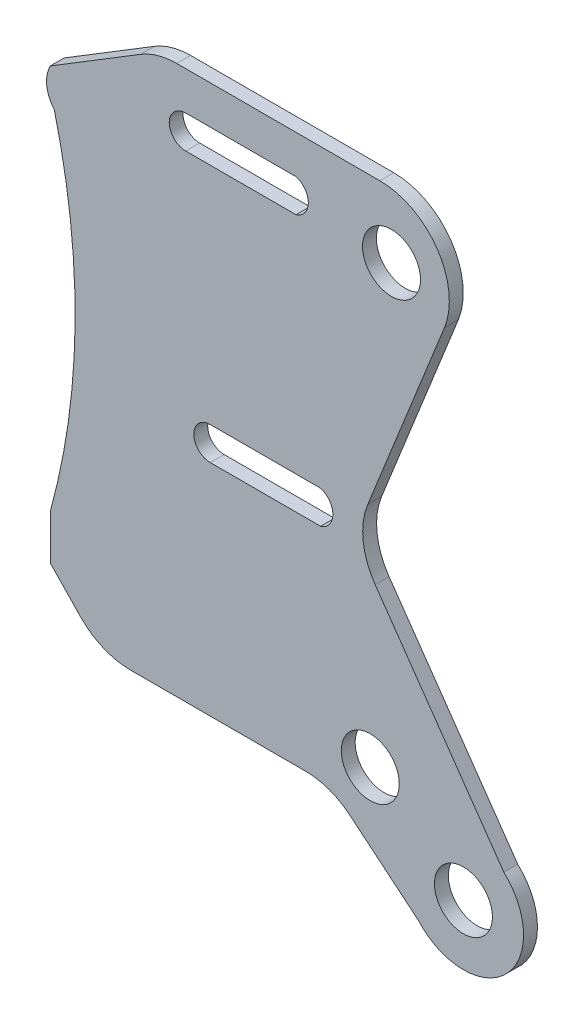
ISO-10303-21;
HEADER;
FILE_DESCRIPTION(('STEP AP214'),'2;1');
FILE_NAME('part.step','',(''),(''),'','','');
FILE_SCHEMA(('AUTOMOTIVE_DESIGN { 1 0 10303 214 1 1 1 1 }'));
ENDSEC;
DATA;
#1=APPLICATION_CONTEXT('core data for automotive mechanical design processes');
#2=APPLICATION_PROTOCOL_DEFINITION('international standard','automotive_design',2000,#1);
#3=PRODUCT_CONTEXT('',#1,'mechanical');
#4=PRODUCT('Part','Part','',(#3));
#5=PRODUCT_RELATED_PRODUCT_CATEGORY('part','',(#4));
#6=PRODUCT_DEFINITION_FORMATION('','',#4);
#7=PRODUCT_DEFINITION_CONTEXT('part definition',#1,'design');
#8=PRODUCT_DEFINITION('design','',#6,#7);
#9=PRODUCT_DEFINITION_SHAPE('','',#8);
#10=(LENGTH_UNIT() NAMED_UNIT(*) SI_UNIT(.MILLI.,.METRE.));
#11=(NAMED_UNIT(*) PLANE_ANGLE_UNIT() SI_UNIT($,.RADIAN.));
#12=(NAMED_UNIT(*) SI_UNIT($,.STERADIAN.) SOLID_ANGLE_UNIT());
#13=UNCERTAINTY_MEASURE_WITH_UNIT(LENGTH_MEASURE(1.E-05),#10,'distance_accuracy_value','');
#14=(GEOMETRIC_REPRESENTATION_CONTEXT(3) GLOBAL_UNCERTAINTY_ASSIGNED_CONTEXT((#13)) GLOBAL_UNIT_ASSIGNED_CONTEXT((#10,
#11,#12)) REPRESENTATION_CONTEXT('',''));
#15=CARTESIAN_POINT('',(0.,0.,0.));
#16=DIRECTION('',(0.,0.,1.));
#17=DIRECTION('',(1.,0.,0.));
#18=AXIS2_PLACEMENT_3D('',#15,#16,#17);
#19=CARTESIAN_POINT('',(7356.27602740988,5480.46152050786,10.));
#20=DIRECTION('',(0.,0.,1.));
#21=DIRECTION('',(1.,0.,0.));
#22=AXIS2_PLACEMENT_3D('',#19,#20,#21);
#23=PLANE('',#22);
#24=CARTESIAN_POINT('',(7633.21644438316,5119.83088755076,10.));
#25=DIRECTION('',(0.,0.,1.));
#26=DIRECTION('',(1.,0.,0.));
#27=AXIS2_PLACEMENT_3D('',#24,#25,#26);
#28=CIRCLE('',#27,20.8632740143078);
#29=CARTESIAN_POINT('',(7654.07971839746,5119.83088755076,10.));
#30=VERTEX_POINT('',#29);
#31=EDGE_CURVE('E267',#30,#30,#28,.T.);
#32=ORIENTED_EDGE('',*,*,#31,.F.);
#33=EDGE_LOOP('',(#32));
#34=FACE_BOUND('',#33,.T.);
#35=CARTESIAN_POINT('',(7356.27602740988,5480.46152050786,10.));
#36=DIRECTION('',(0.,0.,1.));
#37=DIRECTION('',(1.,0.,0.));
#38=AXIS2_PLACEMENT_3D('',#35,#36,#37);
#39=CIRCLE('',#38,23.1074940971523);
#40=CARTESIAN_POINT('',(7335.84521673054,5491.25680922261,10.));
#41=VERTEX_POINT('',#40);
#42=CARTESIAN_POINT('',(7338.75627923221,5465.39451326551,10.));
#43=VERTEX_POINT('',#42);
#44=EDGE_CURVE('E279',#41,#43,#39,.T.);
#45=ORIENTED_EDGE('',*,*,#44,.T.);
#46=CARTESIAN_POINT('',(6862.89927838601,5345.04576288379,10.));
#47=DIRECTION('',(0.,0.,-1.));
#48=DIRECTION('',(-1.,0.,0.));
#49=AXIS2_PLACEMENT_3D('',#46,#47,#48);
#50=CIRCLE('',#49,490.839797665986);
#51=CARTESIAN_POINT('',(7335.84521673054,5213.72232104572,10.));
#52=VERTEX_POINT('',#51);
#53=EDGE_CURVE('E282',#43,#52,#50,.T.);
#54=ORIENTED_EDGE('',*,*,#53,.T.);
#55=DIRECTION('',(0.,-1.,0.));
#56=VECTOR('',#55,1.);
#57=CARTESIAN_POINT('',(7335.84521673054,5213.72232104572,10.));
#58=LINE('',#57,#56);
#59=CARTESIAN_POINT('',(7335.84521673054,5181.42604495919,10.));
#60=VERTEX_POINT('',#59);
#61=EDGE_CURVE('E285',#52,#60,#58,.T.);
#62=ORIENTED_EDGE('',*,*,#61,.T.);
#63=DIRECTION('',(0.69327852464989,-0.720669749094044,0.));
#64=VECTOR('',#63,1.);
#65=CARTESIAN_POINT('',(7335.84521673054,5181.42604495919,10.));
#66=LINE('',#65,#64);
#67=CARTESIAN_POINT('',(7357.51938201795,5158.89553996859,10.));
#68=VERTEX_POINT('',#67);
#69=EDGE_CURVE('E287',#60,#68,#66,.T.);
#70=ORIENTED_EDGE('',*,*,#69,.T.);
#71=CARTESIAN_POINT('',(7393.55286947265,5193.55946620108,10.));
#72=DIRECTION('',(0.,0.,1.));
#73=DIRECTION('',(1.,0.,0.));
#74=AXIS2_PLACEMENT_3D('',#71,#72,#73);
#75=CIRCLE('',#74,49.9999999999999);
#76=CARTESIAN_POINT('',(7393.55286947265,5143.55946620108,10.));
#77=VERTEX_POINT('',#76);
#78=EDGE_CURVE('E289',#68,#77,#75,.T.);
#79=ORIENTED_EDGE('',*,*,#78,.T.);
#80=DIRECTION('',(1.,0.,0.));
#81=VECTOR('',#80,1.);
#82=CARTESIAN_POINT('',(7393.55286947265,5143.55946620108,10.));
#83=LINE('',#82,#81);
#84=CARTESIAN_POINT('',(7519.51954060465,5143.55946620108,10.));
#85=VERTEX_POINT('',#84);
#86=EDGE_CURVE('E291',#77,#85,#83,.T.);
#87=ORIENTED_EDGE('',*,*,#86,.T.);
#88=CARTESIAN_POINT('',(7519.51954060465,5093.55946620108,10.));
#89=DIRECTION('',(0.,0.,-1.));
#90=DIRECTION('',(-1.,0.,0.));
#91=AXIS2_PLACEMENT_3D('',#88,#89,#90);
#92=CIRCLE('',#91,49.9999999999998);
#93=CARTESIAN_POINT('',(7551.41726337819,5132.06317098208,10.));
#94=VERTEX_POINT('',#93);
#95=EDGE_CURVE('E293',#85,#94,#92,.T.);
#96=ORIENTED_EDGE('',*,*,#95,.T.);
#97=DIRECTION('',(0.770074095620001,-0.637954455470794,0.));
#98=VECTOR('',#97,1.);
#99=CARTESIAN_POINT('',(7551.41726337819,5132.06317098208,10.));
#100=LINE('',#99,#98);
#101=CARTESIAN_POINT('',(7600.79956885101,5091.15326117342,10.));
#102=VERTEX_POINT('',#101);
#103=EDGE_CURVE('E295',#94,#102,#100,.T.);
#104=ORIENTED_EDGE('',*,*,#103,.T.);
#105=CARTESIAN_POINT('',(7633.21644438316,5119.83088755076,10.));
#106=DIRECTION('',(0.,0.,1.));
#107=DIRECTION('',(1.,0.,0.));
#108=AXIS2_PLACEMENT_3D('',#105,#106,#107);
#109=CIRCLE('',#108,43.2811745901736);
#110=CARTESIAN_POINT('',(7662.33608576158,5151.85129604124,10.));
#111=VERTEX_POINT('',#110);
#112=EDGE_CURVE('E297',#102,#111,#109,.T.);
#113=ORIENTED_EDGE('',*,*,#112,.T.);
#114=DIRECTION('',(-0.571492903271022,0.820607007958656,0.));
#115=VECTOR('',#114,1.);
#116=CARTESIAN_POINT('',(7569.68086638537,5284.89498198883,10.));
#117=LINE('',#116,#115);
#118=CARTESIAN_POINT('',(7569.68086638537,5284.89498198883,10.));
#119=VERTEX_POINT('',#118);
#120=EDGE_CURVE('E299',#111,#119,#117,.T.);
#121=ORIENTED_EDGE('',*,*,#120,.T.);
#122=CARTESIAN_POINT('',(7610.7112167833,5313.46962715238,10.));
#123=DIRECTION('',(0.,0.,-1.));
#124=DIRECTION('',(1.,0.,0.));
#125=AXIS2_PLACEMENT_3D('',#122,#123,#124);
#126=CIRCLE('',#125,50.0000000000001);
#127=CARTESIAN_POINT('',(7564.30040858429,5332.07169376645,10.));
#128=VERTEX_POINT('',#127);
#129=EDGE_CURVE('E301',#119,#128,#126,.T.);
#130=ORIENTED_EDGE('',*,*,#129,.T.);
#131=DIRECTION('',(0.372041332281536,0.928216163980234,0.));
#132=VECTOR('',#131,1.);
#133=CARTESIAN_POINT('',(7619.47206514531,5469.72097885921,10.));
#134=LINE('',#133,#132);
#135=CARTESIAN_POINT('',(7619.47206514531,5469.72097885921,10.));
#136=VERTEX_POINT('',#135);
#137=EDGE_CURVE('E303',#128,#136,#134,.T.);
#138=ORIENTED_EDGE('',*,*,#137,.T.);
#139=CARTESIAN_POINT('',(7573.0612569463,5488.32304547328,10.));
#140=DIRECTION('',(0.,0.,1.));
#141=DIRECTION('',(-1.,0.,0.));
#142=AXIS2_PLACEMENT_3D('',#139,#140,#141);
#143=CIRCLE('',#142,50.);
#144=CARTESIAN_POINT('',(7573.0612569463,5538.32304547328,10.));
#145=VERTEX_POINT('',#144);
#146=EDGE_CURVE('E305',#136,#145,#143,.T.);
#147=ORIENTED_EDGE('',*,*,#146,.T.);
#148=DIRECTION('',(-1.,0.,0.));
#149=VECTOR('',#148,1.);
#150=CARTESIAN_POINT('',(7426.87365755919,5538.32304547328,10.));
#151=LINE('',#150,#149);
#152=CARTESIAN_POINT('',(7426.87365755919,5538.32304547328,10.));
#153=VERTEX_POINT('',#152);
#154=EDGE_CURVE('E307',#145,#153,#151,.T.);
#155=ORIENTED_EDGE('',*,*,#154,.T.);
#156=CARTESIAN_POINT('',(7426.87365755919,5488.32304547328,10.));
#157=DIRECTION('',(0.,0.,1.));
#158=DIRECTION('',(-1.,0.,0.));
#159=AXIS2_PLACEMENT_3D('',#156,#157,#158);
#160=CIRCLE('',#159,50.);
#161=CARTESIAN_POINT('',(7400.78440837423,5530.97689731535,10.));
#162=VERTEX_POINT('',#161);
#163=EDGE_CURVE('E309',#153,#162,#160,.T.);
#164=ORIENTED_EDGE('',*,*,#163,.T.);
#165=DIRECTION('',(-0.853077036841401,-0.521784983699123,0.));
#166=VECTOR('',#165,1.);
#167=CARTESIAN_POINT('',(7335.84521673054,5491.25680922261,10.));
#168=LINE('',#167,#166);
#169=EDGE_CURVE('E311',#162,#41,#168,.T.);
#170=ORIENTED_EDGE('',*,*,#169,.T.);
#171=EDGE_LOOP('',(#45,#54,#62,#70,#79,#87,#96,#104,#113,#121,#130,#138,#147,#155,#164,#170));
#172=FACE_BOUND('',#171,.T.);
#173=CARTESIAN_POINT('',(7566.17484665191,5169.29533068728,10.));
#174=DIRECTION('',(0.,0.,1.));
#175=DIRECTION('',(1.,0.,0.));
#176=AXIS2_PLACEMENT_3D('',#173,#174,#175);
#177=CIRCLE('',#176,20.8632740143075);
#178=CARTESIAN_POINT('',(7587.03812066622,5169.29533068728,10.));
#179=VERTEX_POINT('',#178);
#180=EDGE_CURVE('E273',#179,#179,#177,.T.);
#181=ORIENTED_EDGE('',*,*,#180,.F.);
#182=EDGE_LOOP('',(#181));
#183=FACE_BOUND('',#182,.T.);
#184=CARTESIAN_POINT('',(7581.43197041039,5491.25680922261,10.));
#185=DIRECTION('',(0.,0.,1.));
#186=DIRECTION('',(1.,0.,0.));
#187=AXIS2_PLACEMENT_3D('',#184,#185,#186);
#188=CIRCLE('',#187,20.8632740143078);
#189=CARTESIAN_POINT('',(7602.2952444247,5491.25680922261,10.));
#190=VERTEX_POINT('',#189);
#191=EDGE_CURVE('E261',#190,#190,#188,.T.);
#192=ORIENTED_EDGE('',*,*,#191,.F.);
#193=EDGE_LOOP('',(#192));
#194=FACE_BOUND('',#193,.T.);
#195=DIRECTION('',(-1.,0.,0.));
#196=VECTOR('',#195,1.);
#197=CARTESIAN_POINT('',(7433.32058826465,5510.67205234695,10.));
#198=LINE('',#197,#196);
#199=CARTESIAN_POINT('',(7512.73477583178,5510.67205234695,10.));
#200=VERTEX_POINT('',#199);
#201=CARTESIAN_POINT('',(7433.32058826465,5510.67205234695,10.));
#202=VERTEX_POINT('',#201);
#203=EDGE_CURVE('E232',#200,#202,#198,.T.);
#204=ORIENTED_EDGE('',*,*,#203,.F.);
#205=CARTESIAN_POINT('',(7509.18663970108,5498.82323077286,10.));
#206=DIRECTION('',(0.,0.,1.));
#207=DIRECTION('',(-1.,0.,0.));
#208=AXIS2_PLACEMENT_3D('',#205,#206,#207);
#209=CIRCLE('',#208,12.3686637393283);
#210=CARTESIAN_POINT('',(7512.73477583178,5486.97440919877,10.));
#211=VERTEX_POINT('',#210);
#212=EDGE_CURVE('E230',#211,#200,#209,.T.);
#213=ORIENTED_EDGE('',*,*,#212,.F.);
#214=DIRECTION('',(1.,0.,0.));
#215=VECTOR('',#214,1.);
#216=CARTESIAN_POINT('',(7512.73477583178,5486.97440919877,10.));
#217=LINE('',#216,#215);
#218=CARTESIAN_POINT('',(7433.32058826465,5486.97440919877,10.));
#219=VERTEX_POINT('',#218);
#220=EDGE_CURVE('E238',#219,#211,#217,.T.);
#221=ORIENTED_EDGE('',*,*,#220,.F.);
#222=CARTESIAN_POINT('',(7433.32058826465,5498.82323077286,10.));
#223=DIRECTION('',(0.,0.,1.));
#224=DIRECTION('',(1.,0.,0.));
#225=AXIS2_PLACEMENT_3D('',#222,#223,#224);
#226=CIRCLE('',#225,11.8488215740884);
#227=EDGE_CURVE('E235',#202,#219,#226,.T.);
#228=ORIENTED_EDGE('',*,*,#227,.F.);
#229=EDGE_LOOP('',(#204,#213,#221,#228));
#230=FACE_BOUND('',#229,.T.);
#231=DIRECTION('',(-1.,0.,0.));
#232=VECTOR('',#231,1.);
#233=CARTESIAN_POINT('',(7451.00945067932,5325.31844872647,10.));
#234=LINE('',#233,#232);
#235=CARTESIAN_POINT('',(7530.42363824645,5325.31844872647,10.));
#236=VERTEX_POINT('',#235);
#237=CARTESIAN_POINT('',(7451.00945067932,5325.31844872647,10.));
#238=VERTEX_POINT('',#237);
#239=EDGE_CURVE('E202',#236,#238,#234,.T.);
#240=ORIENTED_EDGE('',*,*,#239,.F.);
#241=CARTESIAN_POINT('',(7526.87550211575,5313.46962715238,10.));
#242=DIRECTION('',(0.,0.,1.));
#243=DIRECTION('',(-1.,0.,0.));
#244=AXIS2_PLACEMENT_3D('',#241,#242,#243);
#245=CIRCLE('',#244,12.3686637393283);
#246=CARTESIAN_POINT('',(7530.42363824645,5301.62080557829,10.));
#247=VERTEX_POINT('',#246);
#248=EDGE_CURVE('E194',#247,#236,#245,.T.);
#249=ORIENTED_EDGE('',*,*,#248,.F.);
#250=DIRECTION('',(1.,0.,0.));
#251=VECTOR('',#250,1.);
#252=CARTESIAN_POINT('',(7530.42363824645,5301.62080557829,10.));
#253=LINE('',#252,#251);
#254=CARTESIAN_POINT('',(7451.00945067932,5301.62080557829,10.));
#255=VERTEX_POINT('',#254);
#256=EDGE_CURVE('E216',#255,#247,#253,.T.);
#257=ORIENTED_EDGE('',*,*,#256,.F.);
#258=CARTESIAN_POINT('',(7451.00945067932,5313.46962715238,10.));
#259=DIRECTION('',(0.,0.,1.));
#260=DIRECTION('',(1.,0.,0.));
#261=AXIS2_PLACEMENT_3D('',#258,#259,#260);
#262=CIRCLE('',#261,11.8488215740884);
#263=EDGE_CURVE('E214',#238,#255,#262,.T.);
#264=ORIENTED_EDGE('',*,*,#263,.F.);
#265=EDGE_LOOP('',(#240,#249,#257,#264));
#266=FACE_BOUND('',#265,.T.);
#267=ADVANCED_FACE('F33',(#34,#172,#183,#194,#230,#266),#23,.T.);
#268=CARTESIAN_POINT('',(7356.27602740988,5480.46152050786,0.));
#269=DIRECTION('',(0.,0.,1.));
#270=DIRECTION('',(1.,0.,0.));
#271=AXIS2_PLACEMENT_3D('',#268,#269,#270);
#272=PLANE('',#271);
#273=CARTESIAN_POINT('',(7509.18663970108,5498.82323077286,0.));
#274=DIRECTION('',(0.,0.,1.));
#275=DIRECTION('',(-1.,0.,0.));
#276=AXIS2_PLACEMENT_3D('',#273,#274,#275);
#277=CIRCLE('',#276,12.3686637393283);
#278=CARTESIAN_POINT('',(7512.73477583178,5486.97440919877,0.));
#279=VERTEX_POINT('',#278);
#280=CARTESIAN_POINT('',(7512.73477583178,5510.67205234695,0.));
#281=VERTEX_POINT('',#280);
#282=EDGE_CURVE('E210',#279,#281,#277,.T.);
#283=ORIENTED_EDGE('',*,*,#282,.T.);
#284=DIRECTION('',(-1.,0.,0.));
#285=VECTOR('',#284,1.);
#286=CARTESIAN_POINT('',(7433.32058826465,5510.67205234695,0.));
#287=LINE('',#286,#285);
#288=CARTESIAN_POINT('',(7433.32058826465,5510.67205234695,0.));
#289=VERTEX_POINT('',#288);
#290=EDGE_CURVE('E243',#281,#289,#287,.T.);
#291=ORIENTED_EDGE('',*,*,#290,.T.);
#292=CARTESIAN_POINT('',(7433.32058826465,5498.82323077286,0.));
#293=DIRECTION('',(0.,0.,1.));
#294=DIRECTION('',(1.,0.,0.));
#295=AXIS2_PLACEMENT_3D('',#292,#293,#294);
#296=CIRCLE('',#295,11.8488215740884);
#297=CARTESIAN_POINT('',(7433.32058826465,5486.97440919877,0.));
#298=VERTEX_POINT('',#297);
#299=EDGE_CURVE('E246',#289,#298,#296,.T.);
#300=ORIENTED_EDGE('',*,*,#299,.T.);
#301=DIRECTION('',(1.,0.,0.));
#302=VECTOR('',#301,1.);
#303=CARTESIAN_POINT('',(7512.73477583178,5486.97440919877,0.));
#304=LINE('',#303,#302);
#305=EDGE_CURVE('E233',#298,#279,#304,.T.);
#306=ORIENTED_EDGE('',*,*,#305,.T.);
#307=EDGE_LOOP('',(#283,#291,#300,#306));
#308=FACE_BOUND('',#307,.T.);
#309=CARTESIAN_POINT('',(7356.27602740988,5480.46152050786,0.));
#310=DIRECTION('',(0.,0.,1.));
#311=DIRECTION('',(1.,0.,0.));
#312=AXIS2_PLACEMENT_3D('',#309,#310,#311);
#313=CIRCLE('',#312,23.1074940971523);
#314=CARTESIAN_POINT('',(7335.84521673054,5491.25680922261,0.));
#315=VERTEX_POINT('',#314);
#316=CARTESIAN_POINT('',(7338.75627923221,5465.39451326551,0.));
#317=VERTEX_POINT('',#316);
#318=EDGE_CURVE('E276',#315,#317,#313,.T.);
#319=ORIENTED_EDGE('',*,*,#318,.F.);
#320=DIRECTION('',(-0.853077036841401,-0.521784983699123,0.));
#321=VECTOR('',#320,1.);
#322=CARTESIAN_POINT('',(7335.84521673054,5491.25680922261,0.));
#323=LINE('',#322,#321);
#324=CARTESIAN_POINT('',(7400.78440837423,5530.97689731535,0.));
#325=VERTEX_POINT('',#324);
#326=EDGE_CURVE('E283',#325,#315,#323,.T.);
#327=ORIENTED_EDGE('',*,*,#326,.F.);
#328=CARTESIAN_POINT('',(7426.87365755919,5488.32304547328,0.));
#329=DIRECTION('',(0.,0.,1.));
#330=DIRECTION('',(-1.,0.,0.));
#331=AXIS2_PLACEMENT_3D('',#328,#329,#330);
#332=CIRCLE('',#331,50.);
#333=CARTESIAN_POINT('',(7426.87365755919,5538.32304547328,0.));
#334=VERTEX_POINT('',#333);
#335=EDGE_CURVE('E342',#334,#325,#332,.T.);
#336=ORIENTED_EDGE('',*,*,#335,.F.);
#337=DIRECTION('',(-1.,0.,0.));
#338=VECTOR('',#337,1.);
#339=CARTESIAN_POINT('',(7426.87365755919,5538.32304547328,0.));
#340=LINE('',#339,#338);
#341=CARTESIAN_POINT('',(7573.0612569463,5538.32304547328,0.));
#342=VERTEX_POINT('',#341);
#343=EDGE_CURVE('E340',#342,#334,#340,.T.);
#344=ORIENTED_EDGE('',*,*,#343,.F.);
#345=CARTESIAN_POINT('',(7573.0612569463,5488.32304547328,0.));
#346=DIRECTION('',(0.,0.,1.));
#347=DIRECTION('',(-1.,0.,0.));
#348=AXIS2_PLACEMENT_3D('',#345,#346,#347);
#349=CIRCLE('',#348,50.);
#350=CARTESIAN_POINT('',(7619.47206514531,5469.72097885921,0.));
#351=VERTEX_POINT('',#350);
#352=EDGE_CURVE('E338',#351,#342,#349,.T.);
#353=ORIENTED_EDGE('',*,*,#352,.F.);
#354=DIRECTION('',(0.372041332281536,0.928216163980234,0.));
#355=VECTOR('',#354,1.);
#356=CARTESIAN_POINT('',(7619.47206514531,5469.72097885921,0.));
#357=LINE('',#356,#355);
#358=CARTESIAN_POINT('',(7564.30040858429,5332.07169376645,0.));
#359=VERTEX_POINT('',#358);
#360=EDGE_CURVE('E336',#359,#351,#357,.T.);
#361=ORIENTED_EDGE('',*,*,#360,.F.);
#362=CARTESIAN_POINT('',(7610.7112167833,5313.46962715238,0.));
#363=DIRECTION('',(0.,0.,-1.));
#364=DIRECTION('',(1.,0.,0.));
#365=AXIS2_PLACEMENT_3D('',#362,#363,#364);
#366=CIRCLE('',#365,50.0000000000001);
#367=CARTESIAN_POINT('',(7569.68086638537,5284.89498198883,0.));
#368=VERTEX_POINT('',#367);
#369=EDGE_CURVE('E334',#368,#359,#366,.T.);
#370=ORIENTED_EDGE('',*,*,#369,.F.);
#371=DIRECTION('',(-0.571492903271022,0.820607007958656,0.));
#372=VECTOR('',#371,1.);
#373=CARTESIAN_POINT('',(7569.68086638537,5284.89498198883,0.));
#374=LINE('',#373,#372);
#375=CARTESIAN_POINT('',(7662.33608576158,5151.85129604124,0.));
#376=VERTEX_POINT('',#375);
#377=EDGE_CURVE('E332',#376,#368,#374,.T.);
#378=ORIENTED_EDGE('',*,*,#377,.F.);
#379=CARTESIAN_POINT('',(7633.21644438316,5119.83088755076,0.));
#380=DIRECTION('',(0.,0.,1.));
#381=DIRECTION('',(1.,0.,0.));
#382=AXIS2_PLACEMENT_3D('',#379,#380,#381);
#383=CIRCLE('',#382,43.2811745901736);
#384=CARTESIAN_POINT('',(7600.79956885101,5091.15326117342,0.));
#385=VERTEX_POINT('',#384);
#386=EDGE_CURVE('E330',#385,#376,#383,.T.);
#387=ORIENTED_EDGE('',*,*,#386,.F.);
#388=DIRECTION('',(0.770074095620001,-0.637954455470794,0.));
#389=VECTOR('',#388,1.);
#390=CARTESIAN_POINT('',(7551.41726337819,5132.06317098208,0.));
#391=LINE('',#390,#389);
#392=CARTESIAN_POINT('',(7551.41726337819,5132.06317098208,0.));
#393=VERTEX_POINT('',#392);
#394=EDGE_CURVE('E328',#393,#385,#391,.T.);
#395=ORIENTED_EDGE('',*,*,#394,.F.);
#396=CARTESIAN_POINT('',(7519.51954060465,5093.55946620108,0.));
#397=DIRECTION('',(0.,0.,-1.));
#398=DIRECTION('',(-1.,0.,0.));
#399=AXIS2_PLACEMENT_3D('',#396,#397,#398);
#400=CIRCLE('',#399,49.9999999999998);
#401=CARTESIAN_POINT('',(7519.51954060465,5143.55946620108,0.));
#402=VERTEX_POINT('',#401);
#403=EDGE_CURVE('E326',#402,#393,#400,.T.);
#404=ORIENTED_EDGE('',*,*,#403,.F.);
#405=DIRECTION('',(1.,0.,0.));
#406=VECTOR('',#405,1.);
#407=CARTESIAN_POINT('',(7393.55286947265,5143.55946620108,0.));
#408=LINE('',#407,#406);
#409=CARTESIAN_POINT('',(7393.55286947265,5143.55946620108,0.));
#410=VERTEX_POINT('',#409);
#411=EDGE_CURVE('E324',#410,#402,#408,.T.);
#412=ORIENTED_EDGE('',*,*,#411,.F.);
#413=CARTESIAN_POINT('',(7393.55286947265,5193.55946620108,0.));
#414=DIRECTION('',(0.,0.,1.));
#415=DIRECTION('',(1.,0.,0.));
#416=AXIS2_PLACEMENT_3D('',#413,#414,#415);
#417=CIRCLE('',#416,49.9999999999999);
#418=CARTESIAN_POINT('',(7357.51938201795,5158.89553996859,0.));
#419=VERTEX_POINT('',#418);
#420=EDGE_CURVE('E322',#419,#410,#417,.T.);
#421=ORIENTED_EDGE('',*,*,#420,.F.);
#422=DIRECTION('',(0.69327852464989,-0.720669749094044,0.));
#423=VECTOR('',#422,1.);
#424=CARTESIAN_POINT('',(7335.84521673054,5181.42604495919,0.));
#425=LINE('',#424,#423);
#426=CARTESIAN_POINT('',(7335.84521673054,5181.42604495919,0.));
#427=VERTEX_POINT('',#426);
#428=EDGE_CURVE('E320',#427,#419,#425,.T.);
#429=ORIENTED_EDGE('',*,*,#428,.F.);
#430=DIRECTION('',(0.,-1.,0.));
#431=VECTOR('',#430,1.);
#432=CARTESIAN_POINT('',(7335.84521673054,5213.72232104572,0.));
#433=LINE('',#432,#431);
#434=CARTESIAN_POINT('',(7335.84521673054,5213.72232104572,0.));
#435=VERTEX_POINT('',#434);
#436=EDGE_CURVE('E318',#435,#427,#433,.T.);
#437=ORIENTED_EDGE('',*,*,#436,.F.);
#438=CARTESIAN_POINT('',(6862.89927838601,5345.04576288379,0.));
#439=DIRECTION('',(0.,0.,-1.));
#440=DIRECTION('',(-1.,0.,0.));
#441=AXIS2_PLACEMENT_3D('',#438,#439,#440);
#442=CIRCLE('',#441,490.839797665986);
#443=EDGE_CURVE('E316',#317,#435,#442,.T.);
#444=ORIENTED_EDGE('',*,*,#443,.F.);
#445=EDGE_LOOP('',(#319,#327,#336,#344,#353,#361,#370,#378,#387,#395,#404,#412,#421,#429,#437,#444));
#446=FACE_BOUND('',#445,.T.);
#447=CARTESIAN_POINT('',(7566.17484665191,5169.29533068728,0.));
#448=DIRECTION('',(0.,0.,1.));
#449=DIRECTION('',(1.,0.,0.));
#450=AXIS2_PLACEMENT_3D('',#447,#448,#449);
#451=CIRCLE('',#450,20.8632740143075);
#452=CARTESIAN_POINT('',(7587.03812066622,5169.29533068728,0.));
#453=VERTEX_POINT('',#452);
#454=EDGE_CURVE('E270',#453,#453,#451,.T.);
#455=ORIENTED_EDGE('',*,*,#454,.T.);
#456=EDGE_LOOP('',(#455));
#457=FACE_BOUND('',#456,.T.);
#458=CARTESIAN_POINT('',(7633.21644438316,5119.83088755076,0.));
#459=DIRECTION('',(0.,0.,1.));
#460=DIRECTION('',(1.,0.,0.));
#461=AXIS2_PLACEMENT_3D('',#458,#459,#460);
#462=CIRCLE('',#461,20.8632740143078);
#463=CARTESIAN_POINT('',(7654.07971839746,5119.83088755076,0.));
#464=VERTEX_POINT('',#463);
#465=EDGE_CURVE('E264',#464,#464,#462,.T.);
#466=ORIENTED_EDGE('',*,*,#465,.T.);
#467=EDGE_LOOP('',(#466));
#468=FACE_BOUND('',#467,.T.);
#469=CARTESIAN_POINT('',(7581.43197041039,5491.25680922261,0.));
#470=DIRECTION('',(0.,0.,1.));
#471=DIRECTION('',(1.,0.,0.));
#472=AXIS2_PLACEMENT_3D('',#469,#470,#471);
#473=CIRCLE('',#472,20.8632740143078);
#474=CARTESIAN_POINT('',(7602.2952444247,5491.25680922261,0.));
#475=VERTEX_POINT('',#474);
#476=EDGE_CURVE('E260',#475,#475,#473,.T.);
#477=ORIENTED_EDGE('',*,*,#476,.T.);
#478=EDGE_LOOP('',(#477));
#479=FACE_BOUND('',#478,.T.);
#480=CARTESIAN_POINT('',(7526.87550211575,5313.46962715238,0.));
#481=DIRECTION('',(0.,0.,1.));
#482=DIRECTION('',(-1.,0.,0.));
#483=AXIS2_PLACEMENT_3D('',#480,#481,#482);
#484=CIRCLE('',#483,12.3686637393283);
#485=CARTESIAN_POINT('',(7530.42363824645,5301.62080557829,0.));
#486=VERTEX_POINT('',#485);
#487=CARTESIAN_POINT('',(7530.42363824645,5325.31844872647,0.));
#488=VERTEX_POINT('',#487);
#489=EDGE_CURVE('E56',#486,#488,#484,.T.);
#490=ORIENTED_EDGE('',*,*,#489,.T.);
#491=DIRECTION('',(-1.,0.,0.));
#492=VECTOR('',#491,1.);
#493=CARTESIAN_POINT('',(7451.00945067932,5325.31844872647,0.));
#494=LINE('',#493,#492);
#495=CARTESIAN_POINT('',(7451.00945067932,5325.31844872647,0.));
#496=VERTEX_POINT('',#495);
#497=EDGE_CURVE('E209',#488,#496,#494,.T.);
#498=ORIENTED_EDGE('',*,*,#497,.T.);
#499=CARTESIAN_POINT('',(7451.00945067932,5313.46962715238,0.));
#500=DIRECTION('',(0.,0.,1.));
#501=DIRECTION('',(1.,0.,0.));
#502=AXIS2_PLACEMENT_3D('',#499,#500,#501);
#503=CIRCLE('',#502,11.8488215740884);
#504=CARTESIAN_POINT('',(7451.00945067932,5301.62080557829,0.));
#505=VERTEX_POINT('',#504);
#506=EDGE_CURVE('E222',#496,#505,#503,.T.);
#507=ORIENTED_EDGE('',*,*,#506,.T.);
#508=DIRECTION('',(1.,0.,0.));
#509=VECTOR('',#508,1.);
#510=CARTESIAN_POINT('',(7530.42363824645,5301.62080557829,0.));
#511=LINE('',#510,#509);
#512=EDGE_CURVE('E203',#505,#486,#511,.T.);
#513=ORIENTED_EDGE('',*,*,#512,.T.);
#514=EDGE_LOOP('',(#490,#498,#507,#513));
#515=FACE_BOUND('',#514,.T.);
#516=ADVANCED_FACE('F396',(#308,#446,#457,#468,#479,#515),#272,.F.);
#517=CARTESIAN_POINT('',(7356.27602740988,5480.46152050786,10.));
#518=DIRECTION('',(0.,0.,-1.));
#519=DIRECTION('',(-1.,0.,0.));
#520=AXIS2_PLACEMENT_3D('',#517,#518,#519);
#521=CYLINDRICAL_SURFACE('',#520,23.1074940971523);
#522=ORIENTED_EDGE('',*,*,#318,.T.);
#523=DIRECTION('',(0.,0.,-1.));
#524=VECTOR('',#523,1.);
#525=CARTESIAN_POINT('',(7338.75627923221,5465.39451326551,10.));
#526=LINE('',#525,#524);
#527=EDGE_CURVE('E11',#43,#317,#526,.T.);
#528=ORIENTED_EDGE('',*,*,#527,.F.);
#529=ORIENTED_EDGE('',*,*,#44,.F.);
#530=DIRECTION('',(0.,0.,-1.));
#531=VECTOR('',#530,1.);
#532=CARTESIAN_POINT('',(7335.84521673054,5491.25680922261,10.));
#533=LINE('',#532,#531);
#534=EDGE_CURVE('E313',#41,#315,#533,.T.);
#535=ORIENTED_EDGE('',*,*,#534,.T.);
#536=EDGE_LOOP('',(#522,#528,#529,#535));
#537=FACE_BOUND('',#536,.T.);
#538=ADVANCED_FACE('F35',(#537),#521,.T.);
#539=CARTESIAN_POINT('',(6862.89927838601,5345.04576288379,10.));
#540=DIRECTION('',(0.,0.,-1.));
#541=DIRECTION('',(-1.,0.,0.));
#542=AXIS2_PLACEMENT_3D('',#539,#540,#541);
#543=CYLINDRICAL_SURFACE('',#542,490.839797665986);
#544=ORIENTED_EDGE('',*,*,#443,.T.);
#545=DIRECTION('',(0.,0.,-1.));
#546=VECTOR('',#545,1.);
#547=CARTESIAN_POINT('',(7335.84521673054,5213.72232104572,10.));
#548=LINE('',#547,#546);
#549=EDGE_CURVE('E41',#52,#435,#548,.T.);
#550=ORIENTED_EDGE('',*,*,#549,.F.);
#551=ORIENTED_EDGE('',*,*,#53,.F.);
#552=ORIENTED_EDGE('',*,*,#527,.T.);
#553=EDGE_LOOP('',(#544,#550,#551,#552));
#554=FACE_BOUND('',#553,.T.);
#555=ADVANCED_FACE('F414',(#554),#543,.F.);
#556=CARTESIAN_POINT('',(7335.84521673054,5213.72232104572,10.));
#557=DIRECTION('',(1.,0.,0.));
#558=DIRECTION('',(0.,0.,-1.));
#559=AXIS2_PLACEMENT_3D('',#556,#557,#558);
#560=PLANE('',#559);
#561=ORIENTED_EDGE('',*,*,#436,.T.);
#562=DIRECTION('',(0.,0.,-1.));
#563=VECTOR('',#562,1.);
#564=CARTESIAN_POINT('',(7335.84521673054,5181.42604495919,10.));
#565=LINE('',#564,#563);
#566=EDGE_CURVE('E383',#60,#427,#565,.T.);
#567=ORIENTED_EDGE('',*,*,#566,.F.);
#568=ORIENTED_EDGE('',*,*,#61,.F.);
#569=ORIENTED_EDGE('',*,*,#549,.T.);
#570=EDGE_LOOP('',(#561,#567,#568,#569));
#571=FACE_BOUND('',#570,.T.);
#572=ADVANCED_FACE('F390',(#571),#560,.F.);
#573=CARTESIAN_POINT('',(7335.84521673054,5181.42604495919,10.));
#574=DIRECTION('',(0.720669749094044,0.69327852464989,0.));
#575=DIRECTION('',(-0.69327852464989,0.720669749094044,0.));
#576=AXIS2_PLACEMENT_3D('',#573,#574,#575);
#577=PLANE('',#576);
#578=ORIENTED_EDGE('',*,*,#428,.T.);
#579=DIRECTION('',(0.,0.,-1.));
#580=VECTOR('',#579,1.);
#581=CARTESIAN_POINT('',(7357.51938201795,5158.89553996859,10.));
#582=LINE('',#581,#580);
#583=EDGE_CURVE('E380',#68,#419,#582,.T.);
#584=ORIENTED_EDGE('',*,*,#583,.F.);
#585=ORIENTED_EDGE('',*,*,#69,.F.);
#586=ORIENTED_EDGE('',*,*,#566,.T.);
#587=EDGE_LOOP('',(#578,#584,#585,#586));
#588=FACE_BOUND('',#587,.T.);
#589=ADVANCED_FACE('F402',(#588),#577,.F.);
#590=CARTESIAN_POINT('',(7393.55286947265,5193.55946620108,10.));
#591=DIRECTION('',(0.,0.,-1.));
#592=DIRECTION('',(-1.,0.,0.));
#593=AXIS2_PLACEMENT_3D('',#590,#591,#592);
#594=CYLINDRICAL_SURFACE('',#593,49.9999999999999);
#595=ORIENTED_EDGE('',*,*,#420,.T.);
#596=DIRECTION('',(0.,0.,-1.));
#597=VECTOR('',#596,1.);
#598=CARTESIAN_POINT('',(7393.55286947265,5143.55946620108,10.));
#599=LINE('',#598,#597);
#600=EDGE_CURVE('E377',#77,#410,#599,.T.);
#601=ORIENTED_EDGE('',*,*,#600,.F.);
#602=ORIENTED_EDGE('',*,*,#78,.F.);
#603=ORIENTED_EDGE('',*,*,#583,.T.);
#604=EDGE_LOOP('',(#595,#601,#602,#603));
#605=FACE_BOUND('',#604,.T.);
#606=ADVANCED_FACE('F406',(#605),#594,.T.);
#607=CARTESIAN_POINT('',(7393.55286947265,5143.55946620108,10.));
#608=DIRECTION('',(0.,1.,0.));
#609=DIRECTION('',(0.,0.,1.));
#610=AXIS2_PLACEMENT_3D('',#607,#608,#609);
#611=PLANE('',#610);
#612=ORIENTED_EDGE('',*,*,#411,.T.);
#613=DIRECTION('',(0.,0.,-1.));
#614=VECTOR('',#613,1.);
#615=CARTESIAN_POINT('',(7519.51954060465,5143.55946620108,10.));
#616=LINE('',#615,#614);
#617=EDGE_CURVE('E374',#85,#402,#616,.T.);
#618=ORIENTED_EDGE('',*,*,#617,.F.);
#619=ORIENTED_EDGE('',*,*,#86,.F.);
#620=ORIENTED_EDGE('',*,*,#600,.T.);
#621=EDGE_LOOP('',(#612,#618,#619,#620));
#622=FACE_BOUND('',#621,.T.);
#623=ADVANCED_FACE('F467',(#622),#611,.F.);
#624=CARTESIAN_POINT('',(7519.51954060465,5093.55946620108,10.));
#625=DIRECTION('',(0.,0.,-1.));
#626=DIRECTION('',(-1.,0.,0.));
#627=AXIS2_PLACEMENT_3D('',#624,#625,#626);
#628=CYLINDRICAL_SURFACE('',#627,49.9999999999998);
#629=ORIENTED_EDGE('',*,*,#403,.T.);
#630=DIRECTION('',(0.,0.,-1.));
#631=VECTOR('',#630,1.);
#632=CARTESIAN_POINT('',(7551.41726337819,5132.06317098208,10.));
#633=LINE('',#632,#631);
#634=EDGE_CURVE('E371',#94,#393,#633,.T.);
#635=ORIENTED_EDGE('',*,*,#634,.F.);
#636=ORIENTED_EDGE('',*,*,#95,.F.);
#637=ORIENTED_EDGE('',*,*,#617,.T.);
#638=EDGE_LOOP('',(#629,#635,#636,#637));
#639=FACE_BOUND('',#638,.T.);
#640=ADVANCED_FACE('F464',(#639),#628,.F.);
#641=CARTESIAN_POINT('',(7551.41726337819,5132.06317098208,10.));
#642=DIRECTION('',(0.637954455470794,0.770074095620001,0.));
#643=DIRECTION('',(-0.770074095620001,0.637954455470794,0.));
#644=AXIS2_PLACEMENT_3D('',#641,#642,#643);
#645=PLANE('',#644);
#646=ORIENTED_EDGE('',*,*,#394,.T.);
#647=DIRECTION('',(0.,0.,-1.));
#648=VECTOR('',#647,1.);
#649=CARTESIAN_POINT('',(7600.79956885101,5091.15326117342,10.));
#650=LINE('',#649,#648);
#651=EDGE_CURVE('E368',#102,#385,#650,.T.);
#652=ORIENTED_EDGE('',*,*,#651,.F.);
#653=ORIENTED_EDGE('',*,*,#103,.F.);
#654=ORIENTED_EDGE('',*,*,#634,.T.);
#655=EDGE_LOOP('',(#646,#652,#653,#654));
#656=FACE_BOUND('',#655,.T.);
#657=ADVANCED_FACE('F460',(#656),#645,.F.);
#658=CARTESIAN_POINT('',(7633.21644438316,5119.83088755076,10.));
#659=DIRECTION('',(0.,0.,-1.));
#660=DIRECTION('',(-1.,0.,0.));
#661=AXIS2_PLACEMENT_3D('',#658,#659,#660);
#662=CYLINDRICAL_SURFACE('',#661,43.2811745901736);
#663=ORIENTED_EDGE('',*,*,#386,.T.);
#664=DIRECTION('',(0.,0.,-1.));
#665=VECTOR('',#664,1.);
#666=CARTESIAN_POINT('',(7662.33608576158,5151.85129604124,10.));
#667=LINE('',#666,#665);
#668=EDGE_CURVE('E365',#111,#376,#667,.T.);
#669=ORIENTED_EDGE('',*,*,#668,.F.);
#670=ORIENTED_EDGE('',*,*,#112,.F.);
#671=ORIENTED_EDGE('',*,*,#651,.T.);
#672=EDGE_LOOP('',(#663,#669,#670,#671));
#673=FACE_BOUND('',#672,.T.);
#674=ADVANCED_FACE('F456',(#673),#662,.T.);
#675=CARTESIAN_POINT('',(7569.68086638537,5284.89498198883,10.));
#676=DIRECTION('',(-0.820607007958656,-0.571492903271022,0.));
#677=DIRECTION('',(0.571492903271022,-0.820607007958656,0.));
#678=AXIS2_PLACEMENT_3D('',#675,#676,#677);
#679=PLANE('',#678);
#680=ORIENTED_EDGE('',*,*,#377,.T.);
#681=DIRECTION('',(0.,0.,-1.));
#682=VECTOR('',#681,1.);
#683=CARTESIAN_POINT('',(7569.68086638537,5284.89498198883,10.));
#684=LINE('',#683,#682);
#685=EDGE_CURVE('E362',#119,#368,#684,.T.);
#686=ORIENTED_EDGE('',*,*,#685,.F.);
#687=ORIENTED_EDGE('',*,*,#120,.F.);
#688=ORIENTED_EDGE('',*,*,#668,.T.);
#689=EDGE_LOOP('',(#680,#686,#687,#688));
#690=FACE_BOUND('',#689,.T.);
#691=ADVANCED_FACE('F451',(#690),#679,.F.);
#692=CARTESIAN_POINT('',(7610.7112167833,5313.46962715238,10.));
#693=DIRECTION('',(0.,0.,-1.));
#694=DIRECTION('',(-1.,0.,0.));
#695=AXIS2_PLACEMENT_3D('',#692,#693,#694);
#696=CYLINDRICAL_SURFACE('',#695,50.0000000000001);
#697=ORIENTED_EDGE('',*,*,#369,.T.);
#698=DIRECTION('',(0.,0.,-1.));
#699=VECTOR('',#698,1.);
#700=CARTESIAN_POINT('',(7564.30040858429,5332.07169376645,10.));
#701=LINE('',#700,#699);
#702=EDGE_CURVE('E359',#128,#359,#701,.T.);
#703=ORIENTED_EDGE('',*,*,#702,.F.);
#704=ORIENTED_EDGE('',*,*,#129,.F.);
#705=ORIENTED_EDGE('',*,*,#685,.T.);
#706=EDGE_LOOP('',(#697,#703,#704,#705));
#707=FACE_BOUND('',#706,.T.);
#708=ADVANCED_FACE('F445',(#707),#696,.F.);
#709=CARTESIAN_POINT('',(7619.47206514531,5469.72097885921,10.));
#710=DIRECTION('',(-0.928216163980234,0.372041332281536,0.));
#711=DIRECTION('',(-0.372041332281536,-0.928216163980234,0.));
#712=AXIS2_PLACEMENT_3D('',#709,#710,#711);
#713=PLANE('',#712);
#714=ORIENTED_EDGE('',*,*,#360,.T.);
#715=DIRECTION('',(0.,0.,-1.));
#716=VECTOR('',#715,1.);
#717=CARTESIAN_POINT('',(7619.47206514531,5469.72097885921,10.));
#718=LINE('',#717,#716);
#719=EDGE_CURVE('E356',#136,#351,#718,.T.);
#720=ORIENTED_EDGE('',*,*,#719,.F.);
#721=ORIENTED_EDGE('',*,*,#137,.F.);
#722=ORIENTED_EDGE('',*,*,#702,.T.);
#723=EDGE_LOOP('',(#714,#720,#721,#722));
#724=FACE_BOUND('',#723,.T.);
#725=ADVANCED_FACE('F441',(#724),#713,.F.);
#726=CARTESIAN_POINT('',(7573.0612569463,5488.32304547328,10.));
#727=DIRECTION('',(0.,0.,-1.));
#728=DIRECTION('',(-1.,0.,0.));
#729=AXIS2_PLACEMENT_3D('',#726,#727,#728);
#730=CYLINDRICAL_SURFACE('',#729,50.);
#731=ORIENTED_EDGE('',*,*,#352,.T.);
#732=DIRECTION('',(0.,0.,-1.));
#733=VECTOR('',#732,1.);
#734=CARTESIAN_POINT('',(7573.0612569463,5538.32304547328,10.));
#735=LINE('',#734,#733);
#736=EDGE_CURVE('E353',#145,#342,#735,.T.);
#737=ORIENTED_EDGE('',*,*,#736,.F.);
#738=ORIENTED_EDGE('',*,*,#146,.F.);
#739=ORIENTED_EDGE('',*,*,#719,.T.);
#740=EDGE_LOOP('',(#731,#737,#738,#739));
#741=FACE_BOUND('',#740,.T.);
#742=ADVANCED_FACE('F436',(#741),#730,.T.);
#743=CARTESIAN_POINT('',(7426.87365755919,5538.32304547328,10.));
#744=DIRECTION('',(0.,-1.,0.));
#745=DIRECTION('',(0.,0.,-1.));
#746=AXIS2_PLACEMENT_3D('',#743,#744,#745);
#747=PLANE('',#746);
#748=ORIENTED_EDGE('',*,*,#343,.T.);
#749=DIRECTION('',(0.,0.,-1.));
#750=VECTOR('',#749,1.);
#751=CARTESIAN_POINT('',(7426.87365755919,5538.32304547328,10.));
#752=LINE('',#751,#750);
#753=EDGE_CURVE('E350',#153,#334,#752,.T.);
#754=ORIENTED_EDGE('',*,*,#753,.F.);
#755=ORIENTED_EDGE('',*,*,#154,.F.);
#756=ORIENTED_EDGE('',*,*,#736,.T.);
#757=EDGE_LOOP('',(#748,#754,#755,#756));
#758=FACE_BOUND('',#757,.T.);
#759=ADVANCED_FACE('F430',(#758),#747,.F.);
#760=CARTESIAN_POINT('',(7426.87365755919,5488.32304547328,10.));
#761=DIRECTION('',(0.,0.,-1.));
#762=DIRECTION('',(-1.,0.,0.));
#763=AXIS2_PLACEMENT_3D('',#760,#761,#762);
#764=CYLINDRICAL_SURFACE('',#763,50.);
#765=ORIENTED_EDGE('',*,*,#335,.T.);
#766=DIRECTION('',(0.,0.,-1.));
#767=VECTOR('',#766,1.);
#768=CARTESIAN_POINT('',(7400.78440837423,5530.97689731535,10.));
#769=LINE('',#768,#767);
#770=EDGE_CURVE('E347',#162,#325,#769,.T.);
#771=ORIENTED_EDGE('',*,*,#770,.F.);
#772=ORIENTED_EDGE('',*,*,#163,.F.);
#773=ORIENTED_EDGE('',*,*,#753,.T.);
#774=EDGE_LOOP('',(#765,#771,#772,#773));
#775=FACE_BOUND('',#774,.T.);
#776=ADVANCED_FACE('F426',(#775),#764,.T.);
#777=CARTESIAN_POINT('',(7335.84521673054,5491.25680922261,10.));
#778=DIRECTION('',(0.521784983699123,-0.853077036841401,0.));
#779=DIRECTION('',(0.853077036841401,0.521784983699123,0.));
#780=AXIS2_PLACEMENT_3D('',#777,#778,#779);
#781=PLANE('',#780);
#782=ORIENTED_EDGE('',*,*,#326,.T.);
#783=ORIENTED_EDGE('',*,*,#534,.F.);
#784=ORIENTED_EDGE('',*,*,#169,.F.);
#785=ORIENTED_EDGE('',*,*,#770,.T.);
#786=EDGE_LOOP('',(#782,#783,#784,#785));
#787=FACE_BOUND('',#786,.T.);
#788=ADVANCED_FACE('F421',(#787),#781,.F.);
#789=CARTESIAN_POINT('',(7566.17484665191,5169.29533068728,10.));
#790=DIRECTION('',(0.,0.,-1.));
#791=DIRECTION('',(-1.,0.,0.));
#792=AXIS2_PLACEMENT_3D('',#789,#790,#791);
#793=CYLINDRICAL_SURFACE('',#792,20.8632740143075);
#794=ORIENTED_EDGE('',*,*,#180,.T.);
#795=EDGE_LOOP('',(#794));
#796=FACE_BOUND('',#795,.T.);
#797=ORIENTED_EDGE('',*,*,#454,.F.);
#798=EDGE_LOOP('',(#797));
#799=FACE_BOUND('',#798,.T.);
#800=ADVANCED_FACE('F486',(#796,#799),#793,.F.);
#801=CARTESIAN_POINT('',(7633.21644438316,5119.83088755076,10.));
#802=DIRECTION('',(0.,0.,-1.));
#803=DIRECTION('',(-1.,0.,0.));
#804=AXIS2_PLACEMENT_3D('',#801,#802,#803);
#805=CYLINDRICAL_SURFACE('',#804,20.8632740143078);
#806=ORIENTED_EDGE('',*,*,#31,.T.);
#807=EDGE_LOOP('',(#806));
#808=FACE_BOUND('',#807,.T.);
#809=ORIENTED_EDGE('',*,*,#465,.F.);
#810=EDGE_LOOP('',(#809));
#811=FACE_BOUND('',#810,.T.);
#812=ADVANCED_FACE('F548',(#808,#811),#805,.F.);
#813=CARTESIAN_POINT('',(7581.43197041039,5491.25680922261,10.));
#814=DIRECTION('',(0.,0.,-1.));
#815=DIRECTION('',(-1.,0.,0.));
#816=AXIS2_PLACEMENT_3D('',#813,#814,#815);
#817=CYLINDRICAL_SURFACE('',#816,20.8632740143078);
#818=ORIENTED_EDGE('',*,*,#191,.T.);
#819=EDGE_LOOP('',(#818));
#820=FACE_BOUND('',#819,.T.);
#821=ORIENTED_EDGE('',*,*,#476,.F.);
#822=EDGE_LOOP('',(#821));
#823=FACE_BOUND('',#822,.T.);
#824=ADVANCED_FACE('F555',(#820,#823),#817,.F.);
#825=CARTESIAN_POINT('',(7509.18663970108,5498.82323077286,10.));
#826=DIRECTION('',(0.,0.,-1.));
#827=DIRECTION('',(-1.,0.,0.));
#828=AXIS2_PLACEMENT_3D('',#825,#826,#827);
#829=CYLINDRICAL_SURFACE('',#828,12.3686637393283);
#830=ORIENTED_EDGE('',*,*,#282,.F.);
#831=DIRECTION('',(0.,0.,-1.));
#832=VECTOR('',#831,1.);
#833=CARTESIAN_POINT('',(7512.73477583178,5486.97440919877,10.));
#834=LINE('',#833,#832);
#835=EDGE_CURVE('E240',#211,#279,#834,.T.);
#836=ORIENTED_EDGE('',*,*,#835,.F.);
#837=ORIENTED_EDGE('',*,*,#212,.T.);
#838=DIRECTION('',(0.,0.,-1.));
#839=VECTOR('',#838,1.);
#840=CARTESIAN_POINT('',(7512.73477583178,5510.67205234695,10.));
#841=LINE('',#840,#839);
#842=EDGE_CURVE('E257',#200,#281,#841,.T.);
#843=ORIENTED_EDGE('',*,*,#842,.T.);
#844=EDGE_LOOP('',(#830,#836,#837,#843));
#845=FACE_BOUND('',#844,.T.);
#846=ADVANCED_FACE('F562',(#845),#829,.F.);
#847=CARTESIAN_POINT('',(7433.32058826465,5510.67205234695,10.));
#848=DIRECTION('',(0.,-1.,0.));
#849=DIRECTION('',(0.,0.,-1.));
#850=AXIS2_PLACEMENT_3D('',#847,#848,#849);
#851=PLANE('',#850);
#852=ORIENTED_EDGE('',*,*,#290,.F.);
#853=ORIENTED_EDGE('',*,*,#842,.F.);
#854=ORIENTED_EDGE('',*,*,#203,.T.);
#855=DIRECTION('',(0.,0.,-1.));
#856=VECTOR('',#855,1.);
#857=CARTESIAN_POINT('',(7433.32058826465,5510.67205234695,10.));
#858=LINE('',#857,#856);
#859=EDGE_CURVE('E255',#202,#289,#858,.T.);
#860=ORIENTED_EDGE('',*,*,#859,.T.);
#861=EDGE_LOOP('',(#852,#853,#854,#860));
#862=FACE_BOUND('',#861,.T.);
#863=ADVANCED_FACE('F570',(#862),#851,.T.);
#864=CARTESIAN_POINT('',(7433.32058826465,5498.82323077286,10.));
#865=DIRECTION('',(0.,0.,-1.));
#866=DIRECTION('',(-1.,0.,0.));
#867=AXIS2_PLACEMENT_3D('',#864,#865,#866);
#868=CYLINDRICAL_SURFACE('',#867,11.8488215740884);
#869=ORIENTED_EDGE('',*,*,#299,.F.);
#870=ORIENTED_EDGE('',*,*,#859,.F.);
#871=ORIENTED_EDGE('',*,*,#227,.T.);
#872=DIRECTION('',(0.,0.,-1.));
#873=VECTOR('',#872,1.);
#874=CARTESIAN_POINT('',(7433.32058826465,5486.97440919877,10.));
#875=LINE('',#874,#873);
#876=EDGE_CURVE('E253',#219,#298,#875,.T.);
#877=ORIENTED_EDGE('',*,*,#876,.T.);
#878=EDGE_LOOP('',(#869,#870,#871,#877));
#879=FACE_BOUND('',#878,.T.);
#880=ADVANCED_FACE('F578',(#879),#868,.F.);
#881=CARTESIAN_POINT('',(7512.73477583178,5486.97440919877,10.));
#882=DIRECTION('',(0.,1.,0.));
#883=DIRECTION('',(0.,0.,1.));
#884=AXIS2_PLACEMENT_3D('',#881,#882,#883);
#885=PLANE('',#884);
#886=ORIENTED_EDGE('',*,*,#305,.F.);
#887=ORIENTED_EDGE('',*,*,#876,.F.);
#888=ORIENTED_EDGE('',*,*,#220,.T.);
#889=ORIENTED_EDGE('',*,*,#835,.T.);
#890=EDGE_LOOP('',(#886,#887,#888,#889));
#891=FACE_BOUND('',#890,.T.);
#892=ADVANCED_FACE('F586',(#891),#885,.T.);
#893=CARTESIAN_POINT('',(7526.87550211575,5313.46962715238,10.));
#894=DIRECTION('',(0.,0.,-1.));
#895=DIRECTION('',(-1.,0.,0.));
#896=AXIS2_PLACEMENT_3D('',#893,#894,#895);
#897=CYLINDRICAL_SURFACE('',#896,12.3686637393283);
#898=ORIENTED_EDGE('',*,*,#489,.F.);
#899=DIRECTION('',(0.,0.,-1.));
#900=VECTOR('',#899,1.);
#901=CARTESIAN_POINT('',(7530.42363824645,5301.62080557829,10.));
#902=LINE('',#901,#900);
#903=EDGE_CURVE('E198',#247,#486,#902,.T.);
#904=ORIENTED_EDGE('',*,*,#903,.F.);
#905=ORIENTED_EDGE('',*,*,#248,.T.);
#906=DIRECTION('',(0.,0.,-1.));
#907=VECTOR('',#906,1.);
#908=CARTESIAN_POINT('',(7530.42363824645,5325.31844872647,10.));
#909=LINE('',#908,#907);
#910=EDGE_CURVE('E197',#236,#488,#909,.T.);
#911=ORIENTED_EDGE('',*,*,#910,.T.);
#912=EDGE_LOOP('',(#898,#904,#905,#911));
#913=FACE_BOUND('',#912,.T.);
#914=ADVANCED_FACE('F196',(#913),#897,.F.);
#915=CARTESIAN_POINT('',(7451.00945067932,5325.31844872647,10.));
#916=DIRECTION('',(0.,-1.,0.));
#917=DIRECTION('',(0.,0.,-1.));
#918=AXIS2_PLACEMENT_3D('',#915,#916,#917);
#919=PLANE('',#918);
#920=ORIENTED_EDGE('',*,*,#497,.F.);
#921=ORIENTED_EDGE('',*,*,#910,.F.);
#922=ORIENTED_EDGE('',*,*,#239,.T.);
#923=DIRECTION('',(0.,0.,-1.));
#924=VECTOR('',#923,1.);
#925=CARTESIAN_POINT('',(7451.00945067932,5325.31844872647,10.));
#926=LINE('',#925,#924);
#927=EDGE_CURVE('E211',#238,#496,#926,.T.);
#928=ORIENTED_EDGE('',*,*,#927,.T.);
#929=EDGE_LOOP('',(#920,#921,#922,#928));
#930=FACE_BOUND('',#929,.T.);
#931=ADVANCED_FACE('F206',(#930),#919,.T.);
#932=CARTESIAN_POINT('',(7451.00945067932,5313.46962715238,10.));
#933=DIRECTION('',(0.,0.,-1.));
#934=DIRECTION('',(-1.,0.,0.));
#935=AXIS2_PLACEMENT_3D('',#932,#933,#934);
#936=CYLINDRICAL_SURFACE('',#935,11.8488215740884);
#937=ORIENTED_EDGE('',*,*,#506,.F.);
#938=ORIENTED_EDGE('',*,*,#927,.F.);
#939=ORIENTED_EDGE('',*,*,#263,.T.);
#940=DIRECTION('',(0.,0.,-1.));
#941=VECTOR('',#940,1.);
#942=CARTESIAN_POINT('',(7451.00945067932,5301.62080557829,10.));
#943=LINE('',#942,#941);
#944=EDGE_CURVE('E48',#255,#505,#943,.T.);
#945=ORIENTED_EDGE('',*,*,#944,.T.);
#946=EDGE_LOOP('',(#937,#938,#939,#945));
#947=FACE_BOUND('',#946,.T.);
#948=ADVANCED_FACE('F607',(#947),#936,.F.);
#949=CARTESIAN_POINT('',(7530.42363824645,5301.62080557829,10.));
#950=DIRECTION('',(0.,1.,0.));
#951=DIRECTION('',(0.,0.,1.));
#952=AXIS2_PLACEMENT_3D('',#949,#950,#951);
#953=PLANE('',#952);
#954=ORIENTED_EDGE('',*,*,#512,.F.);
#955=ORIENTED_EDGE('',*,*,#944,.F.);
#956=ORIENTED_EDGE('',*,*,#256,.T.);
#957=ORIENTED_EDGE('',*,*,#903,.T.);
#958=EDGE_LOOP('',(#954,#955,#956,#957));
#959=FACE_BOUND('',#958,.T.);
#960=ADVANCED_FACE('F614',(#959),#953,.T.);
#961=CLOSED_SHELL('',(#267,#516,#538,#555,#572,#589,#606,#623,#640,#657,#674,#691,#708,#725,
#742,#759,#776,#788,#800,#812,#824,#846,#863,#880,#892,#914,#931,#948,#960));
#962=MANIFOLD_SOLID_BREP('B2',#961);
#963=ADVANCED_BREP_SHAPE_REPRESENTATION('',(#18,#962),#14);
#964=SHAPE_DEFINITION_REPRESENTATION(#9,#963);
ENDSEC;
END-ISO-10303-21;
